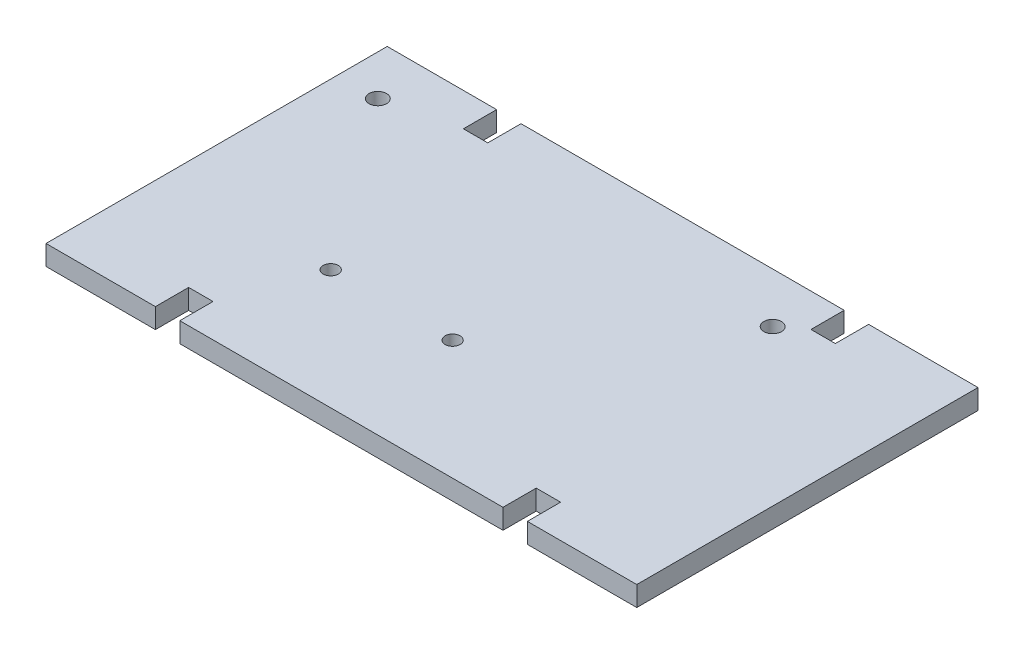
ISO-10303-21;
HEADER;
FILE_DESCRIPTION(('STEP AP214'),'2;1');
FILE_NAME('part.step','',(''),(''),'','','');
FILE_SCHEMA(('AUTOMOTIVE_DESIGN { 1 0 10303 214 1 1 1 1 }'));
ENDSEC;
DATA;
#1=APPLICATION_CONTEXT('core data for automotive mechanical design processes');
#2=APPLICATION_PROTOCOL_DEFINITION('international standard','automotive_design',2000,#1);
#3=PRODUCT_CONTEXT('',#1,'mechanical');
#4=PRODUCT('Part','Part','',(#3));
#5=PRODUCT_RELATED_PRODUCT_CATEGORY('part','',(#4));
#6=PRODUCT_DEFINITION_FORMATION('','',#4);
#7=PRODUCT_DEFINITION_CONTEXT('part definition',#1,'design');
#8=PRODUCT_DEFINITION('design','',#6,#7);
#9=PRODUCT_DEFINITION_SHAPE('','',#8);
#10=(LENGTH_UNIT() NAMED_UNIT(*) SI_UNIT(.MILLI.,.METRE.));
#11=(NAMED_UNIT(*) PLANE_ANGLE_UNIT() SI_UNIT($,.RADIAN.));
#12=(NAMED_UNIT(*) SI_UNIT($,.STERADIAN.) SOLID_ANGLE_UNIT());
#13=UNCERTAINTY_MEASURE_WITH_UNIT(LENGTH_MEASURE(1.E-05),#10,'distance_accuracy_value','');
#14=(GEOMETRIC_REPRESENTATION_CONTEXT(3) GLOBAL_UNCERTAINTY_ASSIGNED_CONTEXT((#13)) GLOBAL_UNIT_ASSIGNED_CONTEXT((#10,
#11,#12)) REPRESENTATION_CONTEXT('',''));
#15=CARTESIAN_POINT('',(0.,0.,0.));
#16=DIRECTION('',(0.,0.,1.));
#17=DIRECTION('',(1.,0.,0.));
#18=AXIS2_PLACEMENT_3D('',#15,#16,#17);
#19=CARTESIAN_POINT('',(67.691,4.572,0.));
#20=DIRECTION('',(1.,0.,0.));
#21=DIRECTION('',(0.,0.,-1.));
#22=AXIS2_PLACEMENT_3D('',#19,#20,#21);
#23=PLANE('',#22);
#24=DIRECTION('',(0.,0.,1.));
#25=VECTOR('',#24,1.);
#26=CARTESIAN_POINT('',(67.691,0.,0.));
#27=LINE('',#26,#25);
#28=CARTESIAN_POINT('',(67.691,0.,-39.1));
#29=VERTEX_POINT('',#28);
#30=CARTESIAN_POINT('',(67.691,0.,39.1));
#31=VERTEX_POINT('',#30);
#32=EDGE_CURVE('E202',#29,#31,#27,.T.);
#33=ORIENTED_EDGE('',*,*,#32,.F.);
#34=DIRECTION('',(0.,-1.,0.));
#35=VECTOR('',#34,1.);
#36=CARTESIAN_POINT('',(67.691,4.572,-39.1));
#37=LINE('',#36,#35);
#38=CARTESIAN_POINT('',(67.691,4.572,-39.1));
#39=VERTEX_POINT('',#38);
#40=EDGE_CURVE('E11',#39,#29,#37,.T.);
#41=ORIENTED_EDGE('',*,*,#40,.F.);
#42=DIRECTION('',(0.,0.,1.));
#43=VECTOR('',#42,1.);
#44=CARTESIAN_POINT('',(67.691,4.572,0.));
#45=LINE('',#44,#43);
#46=CARTESIAN_POINT('',(67.691,4.572,39.1));
#47=VERTEX_POINT('',#46);
#48=EDGE_CURVE('E253',#39,#47,#45,.T.);
#49=ORIENTED_EDGE('',*,*,#48,.T.);
#50=DIRECTION('',(0.,-1.,0.));
#51=VECTOR('',#50,1.);
#52=CARTESIAN_POINT('',(67.691,4.572,39.1));
#53=LINE('',#52,#51);
#54=EDGE_CURVE('E51',#47,#31,#53,.T.);
#55=ORIENTED_EDGE('',*,*,#54,.T.);
#56=EDGE_LOOP('',(#33,#41,#49,#55));
#57=FACE_BOUND('',#56,.T.);
#58=ADVANCED_FACE('F35',(#57),#23,.T.);
#59=CARTESIAN_POINT('',(0.,4.572,-39.1));
#60=DIRECTION('',(0.,0.,1.));
#61=DIRECTION('',(1.,0.,0.));
#62=AXIS2_PLACEMENT_3D('',#59,#60,#61);
#63=PLANE('',#62);
#64=DIRECTION('',(-1.,0.,0.));
#65=VECTOR('',#64,1.);
#66=CARTESIAN_POINT('',(0.,0.,-39.1));
#67=LINE('',#66,#65);
#68=CARTESIAN_POINT('',(42.6212,0.,-39.1));
#69=VERTEX_POINT('',#68);
#70=EDGE_CURVE('E204',#29,#69,#67,.T.);
#71=ORIENTED_EDGE('',*,*,#70,.T.);
#72=DIRECTION('',(0.,-1.,0.));
#73=VECTOR('',#72,1.);
#74=CARTESIAN_POINT('',(42.6212,4.572,-39.1));
#75=LINE('',#74,#73);
#76=CARTESIAN_POINT('',(42.6212,4.572,-39.1));
#77=VERTEX_POINT('',#76);
#78=EDGE_CURVE('E43',#77,#69,#75,.T.);
#79=ORIENTED_EDGE('',*,*,#78,.F.);
#80=DIRECTION('',(-1.,0.,0.));
#81=VECTOR('',#80,1.);
#82=CARTESIAN_POINT('',(0.,4.572,-39.1));
#83=LINE('',#82,#81);
#84=EDGE_CURVE('E307',#39,#77,#83,.T.);
#85=ORIENTED_EDGE('',*,*,#84,.F.);
#86=ORIENTED_EDGE('',*,*,#40,.T.);
#87=EDGE_LOOP('',(#71,#79,#85,#86));
#88=FACE_BOUND('',#87,.T.);
#89=ADVANCED_FACE('F296',(#88),#63,.F.);
#90=CARTESIAN_POINT('',(42.6212000000001,4.572,-1.16434639707564E-13));
#91=DIRECTION('',(-1.,0.,0.));
#92=DIRECTION('',(0.,0.,1.));
#93=AXIS2_PLACEMENT_3D('',#90,#91,#92);
#94=PLANE('',#93);
#95=DIRECTION('',(0.,0.,-1.));
#96=VECTOR('',#95,1.);
#97=CARTESIAN_POINT('',(42.6212000000001,0.,-1.16434639707564E-13));
#98=LINE('',#97,#96);
#99=CARTESIAN_POINT('',(42.6212,0.,-31.48));
#100=VERTEX_POINT('',#99);
#101=EDGE_CURVE('E208',#100,#69,#98,.T.);
#102=ORIENTED_EDGE('',*,*,#101,.F.);
#103=DIRECTION('',(0.,-1.,0.));
#104=VECTOR('',#103,1.);
#105=CARTESIAN_POINT('',(42.6212,4.572,-31.48));
#106=LINE('',#105,#104);
#107=CARTESIAN_POINT('',(42.6212,4.572,-31.48));
#108=VERTEX_POINT('',#107);
#109=EDGE_CURVE('E286',#108,#100,#106,.T.);
#110=ORIENTED_EDGE('',*,*,#109,.F.);
#111=DIRECTION('',(0.,0.,-1.));
#112=VECTOR('',#111,1.);
#113=CARTESIAN_POINT('',(42.6212000000001,4.572,-1.16434639707564E-13));
#114=LINE('',#113,#112);
#115=EDGE_CURVE('E293',#108,#77,#114,.T.);
#116=ORIENTED_EDGE('',*,*,#115,.T.);
#117=ORIENTED_EDGE('',*,*,#78,.T.);
#118=EDGE_LOOP('',(#102,#110,#116,#117));
#119=FACE_BOUND('',#118,.T.);
#120=ADVANCED_FACE('F291',(#119),#94,.T.);
#121=CARTESIAN_POINT('',(0.,4.572,-31.48));
#122=DIRECTION('',(0.,0.,-1.));
#123=DIRECTION('',(-1.,0.,0.));
#124=AXIS2_PLACEMENT_3D('',#121,#122,#123);
#125=PLANE('',#124);
#126=DIRECTION('',(1.,0.,0.));
#127=VECTOR('',#126,1.);
#128=CARTESIAN_POINT('',(0.,0.,-31.48));
#129=LINE('',#128,#127);
#130=CARTESIAN_POINT('',(37.0332,0.,-31.48));
#131=VERTEX_POINT('',#130);
#132=EDGE_CURVE('E211',#131,#100,#129,.T.);
#133=ORIENTED_EDGE('',*,*,#132,.F.);
#134=DIRECTION('',(0.,-1.,0.));
#135=VECTOR('',#134,1.);
#136=CARTESIAN_POINT('',(37.0332,4.572,-31.48));
#137=LINE('',#136,#135);
#138=CARTESIAN_POINT('',(37.0332,4.572,-31.48));
#139=VERTEX_POINT('',#138);
#140=EDGE_CURVE('E284',#139,#131,#137,.T.);
#141=ORIENTED_EDGE('',*,*,#140,.F.);
#142=DIRECTION('',(1.,0.,0.));
#143=VECTOR('',#142,1.);
#144=CARTESIAN_POINT('',(0.,4.572,-31.48));
#145=LINE('',#144,#143);
#146=EDGE_CURVE('E306',#139,#108,#145,.T.);
#147=ORIENTED_EDGE('',*,*,#146,.T.);
#148=ORIENTED_EDGE('',*,*,#109,.T.);
#149=EDGE_LOOP('',(#133,#141,#147,#148));
#150=FACE_BOUND('',#149,.T.);
#151=ADVANCED_FACE('F302',(#150),#125,.T.);
#152=CARTESIAN_POINT('',(37.0331999999999,4.572,0.));
#153=DIRECTION('',(-1.,0.,0.));
#154=DIRECTION('',(0.,0.,1.));
#155=AXIS2_PLACEMENT_3D('',#152,#153,#154);
#156=PLANE('',#155);
#157=DIRECTION('',(0.,0.,-1.));
#158=VECTOR('',#157,1.);
#159=CARTESIAN_POINT('',(37.0331999999999,0.,0.));
#160=LINE('',#159,#158);
#161=CARTESIAN_POINT('',(37.0332,0.,-39.1));
#162=VERTEX_POINT('',#161);
#163=EDGE_CURVE('E214',#131,#162,#160,.T.);
#164=ORIENTED_EDGE('',*,*,#163,.T.);
#165=DIRECTION('',(0.,-1.,0.));
#166=VECTOR('',#165,1.);
#167=CARTESIAN_POINT('',(37.0332,4.572,-39.1));
#168=LINE('',#167,#166);
#169=CARTESIAN_POINT('',(37.0332,4.572,-39.1));
#170=VERTEX_POINT('',#169);
#171=EDGE_CURVE('E282',#170,#162,#168,.T.);
#172=ORIENTED_EDGE('',*,*,#171,.F.);
#173=DIRECTION('',(0.,0.,-1.));
#174=VECTOR('',#173,1.);
#175=CARTESIAN_POINT('',(37.0331999999999,4.572,0.));
#176=LINE('',#175,#174);
#177=EDGE_CURVE('E309',#139,#170,#176,.T.);
#178=ORIENTED_EDGE('',*,*,#177,.F.);
#179=ORIENTED_EDGE('',*,*,#140,.T.);
#180=EDGE_LOOP('',(#164,#172,#178,#179));
#181=FACE_BOUND('',#180,.T.);
#182=ADVANCED_FACE('F362',(#181),#156,.F.);
#183=CARTESIAN_POINT('',(0.,4.572,-39.1));
#184=DIRECTION('',(0.,0.,-1.));
#185=DIRECTION('',(-1.,0.,0.));
#186=AXIS2_PLACEMENT_3D('',#183,#184,#185);
#187=PLANE('',#186);
#188=DIRECTION('',(1.,0.,0.));
#189=VECTOR('',#188,1.);
#190=CARTESIAN_POINT('',(0.,0.,-39.1));
#191=LINE('',#190,#189);
#192=CARTESIAN_POINT('',(-37.0332,0.,-39.1));
#193=VERTEX_POINT('',#192);
#194=EDGE_CURVE('E218',#193,#162,#191,.T.);
#195=ORIENTED_EDGE('',*,*,#194,.F.);
#196=DIRECTION('',(0.,-1.,0.));
#197=VECTOR('',#196,1.);
#198=CARTESIAN_POINT('',(-37.0332,4.572,-39.1));
#199=LINE('',#198,#197);
#200=CARTESIAN_POINT('',(-37.0332,4.572,-39.1));
#201=VERTEX_POINT('',#200);
#202=EDGE_CURVE('E280',#201,#193,#199,.T.);
#203=ORIENTED_EDGE('',*,*,#202,.F.);
#204=DIRECTION('',(1.,0.,0.));
#205=VECTOR('',#204,1.);
#206=CARTESIAN_POINT('',(0.,4.572,-39.1));
#207=LINE('',#206,#205);
#208=EDGE_CURVE('E316',#201,#170,#207,.T.);
#209=ORIENTED_EDGE('',*,*,#208,.T.);
#210=ORIENTED_EDGE('',*,*,#171,.T.);
#211=EDGE_LOOP('',(#195,#203,#209,#210));
#212=FACE_BOUND('',#211,.T.);
#213=ADVANCED_FACE('F365',(#212),#187,.T.);
#214=CARTESIAN_POINT('',(-37.0331999999999,4.572,0.));
#215=DIRECTION('',(-1.,0.,0.));
#216=DIRECTION('',(0.,0.,1.));
#217=AXIS2_PLACEMENT_3D('',#214,#215,#216);
#218=PLANE('',#217);
#219=DIRECTION('',(0.,0.,-1.));
#220=VECTOR('',#219,1.);
#221=CARTESIAN_POINT('',(-37.0331999999999,0.,0.));
#222=LINE('',#221,#220);
#223=CARTESIAN_POINT('',(-37.0331999999999,0.,-31.48));
#224=VERTEX_POINT('',#223);
#225=EDGE_CURVE('E221',#224,#193,#222,.T.);
#226=ORIENTED_EDGE('',*,*,#225,.F.);
#227=DIRECTION('',(0.,-1.,0.));
#228=VECTOR('',#227,1.);
#229=CARTESIAN_POINT('',(-37.0331999999999,4.572,-31.48));
#230=LINE('',#229,#228);
#231=CARTESIAN_POINT('',(-37.0331999999999,4.572,-31.48));
#232=VERTEX_POINT('',#231);
#233=EDGE_CURVE('E278',#232,#224,#230,.T.);
#234=ORIENTED_EDGE('',*,*,#233,.F.);
#235=DIRECTION('',(0.,0.,-1.));
#236=VECTOR('',#235,1.);
#237=CARTESIAN_POINT('',(-37.0331999999999,4.572,0.));
#238=LINE('',#237,#236);
#239=EDGE_CURVE('E319',#232,#201,#238,.T.);
#240=ORIENTED_EDGE('',*,*,#239,.T.);
#241=ORIENTED_EDGE('',*,*,#202,.T.);
#242=EDGE_LOOP('',(#226,#234,#240,#241));
#243=FACE_BOUND('',#242,.T.);
#244=ADVANCED_FACE('F369',(#243),#218,.T.);
#245=CARTESIAN_POINT('',(-42.6212,0.,-31.48));
#246=VERTEX_POINT('',#245);
#247=EDGE_CURVE('E215',#246,#224,#129,.T.);
#248=ORIENTED_EDGE('',*,*,#247,.F.);
#249=DIRECTION('',(0.,-1.,0.));
#250=VECTOR('',#249,1.);
#251=CARTESIAN_POINT('',(-42.6212,4.572,-31.48));
#252=LINE('',#251,#250);
#253=CARTESIAN_POINT('',(-42.6212,4.572,-31.48));
#254=VERTEX_POINT('',#253);
#255=EDGE_CURVE('E276',#254,#246,#252,.T.);
#256=ORIENTED_EDGE('',*,*,#255,.F.);
#257=EDGE_CURVE('E311',#254,#232,#145,.T.);
#258=ORIENTED_EDGE('',*,*,#257,.T.);
#259=ORIENTED_EDGE('',*,*,#233,.T.);
#260=EDGE_LOOP('',(#248,#256,#258,#259));
#261=FACE_BOUND('',#260,.T.);
#262=ADVANCED_FACE('F373',(#261),#125,.T.);
#263=CARTESIAN_POINT('',(-42.6212000000001,4.572,0.));
#264=DIRECTION('',(-1.,0.,0.));
#265=DIRECTION('',(0.,0.,1.));
#266=AXIS2_PLACEMENT_3D('',#263,#264,#265);
#267=PLANE('',#266);
#268=DIRECTION('',(0.,0.,-1.));
#269=VECTOR('',#268,1.);
#270=CARTESIAN_POINT('',(-42.6212000000001,0.,0.));
#271=LINE('',#270,#269);
#272=CARTESIAN_POINT('',(-42.6212,0.,-39.1));
#273=VERTEX_POINT('',#272);
#274=EDGE_CURVE('E224',#246,#273,#271,.T.);
#275=ORIENTED_EDGE('',*,*,#274,.T.);
#276=DIRECTION('',(0.,-1.,0.));
#277=VECTOR('',#276,1.);
#278=CARTESIAN_POINT('',(-42.6212,4.572,-39.1));
#279=LINE('',#278,#277);
#280=CARTESIAN_POINT('',(-42.6212,4.572,-39.1));
#281=VERTEX_POINT('',#280);
#282=EDGE_CURVE('E274',#281,#273,#279,.T.);
#283=ORIENTED_EDGE('',*,*,#282,.F.);
#284=DIRECTION('',(0.,0.,-1.));
#285=VECTOR('',#284,1.);
#286=CARTESIAN_POINT('',(-42.6212000000001,4.572,0.));
#287=LINE('',#286,#285);
#288=EDGE_CURVE('E322',#254,#281,#287,.T.);
#289=ORIENTED_EDGE('',*,*,#288,.F.);
#290=ORIENTED_EDGE('',*,*,#255,.T.);
#291=EDGE_LOOP('',(#275,#283,#289,#290));
#292=FACE_BOUND('',#291,.T.);
#293=ADVANCED_FACE('F377',(#292),#267,.F.);
#294=CARTESIAN_POINT('',(0.,4.572,-39.1));
#295=DIRECTION('',(0.,0.,-1.));
#296=DIRECTION('',(-1.,0.,0.));
#297=AXIS2_PLACEMENT_3D('',#294,#295,#296);
#298=PLANE('',#297);
#299=DIRECTION('',(1.,0.,0.));
#300=VECTOR('',#299,1.);
#301=CARTESIAN_POINT('',(0.,0.,-39.1));
#302=LINE('',#301,#300);
#303=CARTESIAN_POINT('',(-67.691,0.,-39.1));
#304=VERTEX_POINT('',#303);
#305=EDGE_CURVE('E227',#304,#273,#302,.T.);
#306=ORIENTED_EDGE('',*,*,#305,.F.);
#307=DIRECTION('',(0.,-1.,0.));
#308=VECTOR('',#307,1.);
#309=CARTESIAN_POINT('',(-67.691,4.572,-39.1));
#310=LINE('',#309,#308);
#311=CARTESIAN_POINT('',(-67.691,4.572,-39.1));
#312=VERTEX_POINT('',#311);
#313=EDGE_CURVE('E272',#312,#304,#310,.T.);
#314=ORIENTED_EDGE('',*,*,#313,.F.);
#315=DIRECTION('',(1.,0.,0.));
#316=VECTOR('',#315,1.);
#317=CARTESIAN_POINT('',(0.,4.572,-39.1));
#318=LINE('',#317,#316);
#319=EDGE_CURVE('E324',#312,#281,#318,.T.);
#320=ORIENTED_EDGE('',*,*,#319,.T.);
#321=ORIENTED_EDGE('',*,*,#282,.T.);
#322=EDGE_LOOP('',(#306,#314,#320,#321));
#323=FACE_BOUND('',#322,.T.);
#324=ADVANCED_FACE('F381',(#323),#298,.T.);
#325=CARTESIAN_POINT('',(-67.691,4.572,0.));
#326=DIRECTION('',(1.,0.,0.));
#327=DIRECTION('',(0.,0.,-1.));
#328=AXIS2_PLACEMENT_3D('',#325,#326,#327);
#329=PLANE('',#328);
#330=DIRECTION('',(0.,0.,1.));
#331=VECTOR('',#330,1.);
#332=CARTESIAN_POINT('',(-67.691,0.,0.));
#333=LINE('',#332,#331);
#334=CARTESIAN_POINT('',(-67.691,0.,39.1));
#335=VERTEX_POINT('',#334);
#336=EDGE_CURVE('E230',#304,#335,#333,.T.);
#337=ORIENTED_EDGE('',*,*,#336,.T.);
#338=DIRECTION('',(0.,-1.,0.));
#339=VECTOR('',#338,1.);
#340=CARTESIAN_POINT('',(-67.691,4.572,39.1));
#341=LINE('',#340,#339);
#342=CARTESIAN_POINT('',(-67.691,4.572,39.1));
#343=VERTEX_POINT('',#342);
#344=EDGE_CURVE('E269',#343,#335,#341,.T.);
#345=ORIENTED_EDGE('',*,*,#344,.F.);
#346=DIRECTION('',(0.,0.,1.));
#347=VECTOR('',#346,1.);
#348=CARTESIAN_POINT('',(-67.691,4.572,0.));
#349=LINE('',#348,#347);
#350=EDGE_CURVE('E327',#312,#343,#349,.T.);
#351=ORIENTED_EDGE('',*,*,#350,.F.);
#352=ORIENTED_EDGE('',*,*,#313,.T.);
#353=EDGE_LOOP('',(#337,#345,#351,#352));
#354=FACE_BOUND('',#353,.T.);
#355=ADVANCED_FACE('F385',(#354),#329,.F.);
#356=CARTESIAN_POINT('',(0.,4.572,39.1));
#357=DIRECTION('',(0.,0.,-1.));
#358=DIRECTION('',(-1.,0.,0.));
#359=AXIS2_PLACEMENT_3D('',#356,#357,#358);
#360=PLANE('',#359);
#361=DIRECTION('',(1.,0.,0.));
#362=VECTOR('',#361,1.);
#363=CARTESIAN_POINT('',(0.,0.,39.1));
#364=LINE('',#363,#362);
#365=CARTESIAN_POINT('',(-42.6212,0.,39.1));
#366=VERTEX_POINT('',#365);
#367=EDGE_CURVE('E232',#335,#366,#364,.T.);
#368=ORIENTED_EDGE('',*,*,#367,.T.);
#369=DIRECTION('',(0.,-1.,0.));
#370=VECTOR('',#369,1.);
#371=CARTESIAN_POINT('',(-42.6212,4.572,39.1));
#372=LINE('',#371,#370);
#373=CARTESIAN_POINT('',(-42.6212,4.572,39.1));
#374=VERTEX_POINT('',#373);
#375=EDGE_CURVE('E267',#374,#366,#372,.T.);
#376=ORIENTED_EDGE('',*,*,#375,.F.);
#377=DIRECTION('',(1.,0.,0.));
#378=VECTOR('',#377,1.);
#379=CARTESIAN_POINT('',(0.,4.572,39.1));
#380=LINE('',#379,#378);
#381=EDGE_CURVE('E329',#343,#374,#380,.T.);
#382=ORIENTED_EDGE('',*,*,#381,.F.);
#383=ORIENTED_EDGE('',*,*,#344,.T.);
#384=EDGE_LOOP('',(#368,#376,#382,#383));
#385=FACE_BOUND('',#384,.T.);
#386=ADVANCED_FACE('F389',(#385),#360,.F.);
#387=CARTESIAN_POINT('',(-42.6212000000001,4.572,1.16434639707564E-13));
#388=DIRECTION('',(1.,0.,0.));
#389=DIRECTION('',(0.,0.,-1.));
#390=AXIS2_PLACEMENT_3D('',#387,#388,#389);
#391=PLANE('',#390);
#392=DIRECTION('',(0.,0.,1.));
#393=VECTOR('',#392,1.);
#394=CARTESIAN_POINT('',(-42.6212000000001,0.,1.16434639707564E-13));
#395=LINE('',#394,#393);
#396=CARTESIAN_POINT('',(-42.6212,0.,31.48));
#397=VERTEX_POINT('',#396);
#398=EDGE_CURVE('E235',#397,#366,#395,.T.);
#399=ORIENTED_EDGE('',*,*,#398,.F.);
#400=DIRECTION('',(0.,-1.,0.));
#401=VECTOR('',#400,1.);
#402=CARTESIAN_POINT('',(-42.6212,4.572,31.48));
#403=LINE('',#402,#401);
#404=CARTESIAN_POINT('',(-42.6212,4.572,31.48));
#405=VERTEX_POINT('',#404);
#406=EDGE_CURVE('E265',#405,#397,#403,.T.);
#407=ORIENTED_EDGE('',*,*,#406,.F.);
#408=DIRECTION('',(0.,0.,1.));
#409=VECTOR('',#408,1.);
#410=CARTESIAN_POINT('',(-42.6212000000001,4.572,1.16434639707564E-13));
#411=LINE('',#410,#409);
#412=EDGE_CURVE('E331',#405,#374,#411,.T.);
#413=ORIENTED_EDGE('',*,*,#412,.T.);
#414=ORIENTED_EDGE('',*,*,#375,.T.);
#415=EDGE_LOOP('',(#399,#407,#413,#414));
#416=FACE_BOUND('',#415,.T.);
#417=ADVANCED_FACE('F393',(#416),#391,.T.);
#418=CARTESIAN_POINT('',(0.,4.572,31.48));
#419=DIRECTION('',(0.,0.,-1.));
#420=DIRECTION('',(-1.,0.,0.));
#421=AXIS2_PLACEMENT_3D('',#418,#419,#420);
#422=PLANE('',#421);
#423=DIRECTION('',(1.,0.,0.));
#424=VECTOR('',#423,1.);
#425=CARTESIAN_POINT('',(0.,0.,31.48));
#426=LINE('',#425,#424);
#427=CARTESIAN_POINT('',(-37.0331999999999,0.,31.48));
#428=VERTEX_POINT('',#427);
#429=EDGE_CURVE('E238',#397,#428,#426,.T.);
#430=ORIENTED_EDGE('',*,*,#429,.T.);
#431=DIRECTION('',(0.,-1.,0.));
#432=VECTOR('',#431,1.);
#433=CARTESIAN_POINT('',(-37.0331999999999,4.572,31.48));
#434=LINE('',#433,#432);
#435=CARTESIAN_POINT('',(-37.0331999999999,4.572,31.48));
#436=VERTEX_POINT('',#435);
#437=EDGE_CURVE('E262',#436,#428,#434,.T.);
#438=ORIENTED_EDGE('',*,*,#437,.F.);
#439=DIRECTION('',(1.,0.,0.));
#440=VECTOR('',#439,1.);
#441=CARTESIAN_POINT('',(0.,4.572,31.48));
#442=LINE('',#441,#440);
#443=EDGE_CURVE('E185',#405,#436,#442,.T.);
#444=ORIENTED_EDGE('',*,*,#443,.F.);
#445=ORIENTED_EDGE('',*,*,#406,.T.);
#446=EDGE_LOOP('',(#430,#438,#444,#445));
#447=FACE_BOUND('',#446,.T.);
#448=ADVANCED_FACE('F397',(#447),#422,.F.);
#449=CARTESIAN_POINT('',(-37.0331999999999,4.572,0.));
#450=DIRECTION('',(1.,0.,0.));
#451=DIRECTION('',(0.,0.,-1.));
#452=AXIS2_PLACEMENT_3D('',#449,#450,#451);
#453=PLANE('',#452);
#454=DIRECTION('',(0.,0.,1.));
#455=VECTOR('',#454,1.);
#456=CARTESIAN_POINT('',(-37.0331999999999,0.,0.));
#457=LINE('',#456,#455);
#458=CARTESIAN_POINT('',(-37.0332,0.,39.1));
#459=VERTEX_POINT('',#458);
#460=EDGE_CURVE('E240',#428,#459,#457,.T.);
#461=ORIENTED_EDGE('',*,*,#460,.T.);
#462=DIRECTION('',(0.,-1.,0.));
#463=VECTOR('',#462,1.);
#464=CARTESIAN_POINT('',(-37.0332,4.572,39.1));
#465=LINE('',#464,#463);
#466=CARTESIAN_POINT('',(-37.0332,4.572,39.1));
#467=VERTEX_POINT('',#466);
#468=EDGE_CURVE('E259',#467,#459,#465,.T.);
#469=ORIENTED_EDGE('',*,*,#468,.F.);
#470=DIRECTION('',(0.,0.,1.));
#471=VECTOR('',#470,1.);
#472=CARTESIAN_POINT('',(-37.0331999999999,4.572,0.));
#473=LINE('',#472,#471);
#474=EDGE_CURVE('E334',#436,#467,#473,.T.);
#475=ORIENTED_EDGE('',*,*,#474,.F.);
#476=ORIENTED_EDGE('',*,*,#437,.T.);
#477=EDGE_LOOP('',(#461,#469,#475,#476));
#478=FACE_BOUND('',#477,.T.);
#479=ADVANCED_FACE('F399',(#478),#453,.F.);
#480=CARTESIAN_POINT('',(0.,4.572,39.1));
#481=DIRECTION('',(0.,0.,-1.));
#482=DIRECTION('',(-1.,0.,0.));
#483=AXIS2_PLACEMENT_3D('',#480,#481,#482);
#484=PLANE('',#483);
#485=DIRECTION('',(1.,0.,0.));
#486=VECTOR('',#485,1.);
#487=CARTESIAN_POINT('',(0.,0.,39.1));
#488=LINE('',#487,#486);
#489=CARTESIAN_POINT('',(37.0332,0.,39.1));
#490=VERTEX_POINT('',#489);
#491=EDGE_CURVE('E242',#459,#490,#488,.T.);
#492=ORIENTED_EDGE('',*,*,#491,.T.);
#493=DIRECTION('',(0.,-1.,0.));
#494=VECTOR('',#493,1.);
#495=CARTESIAN_POINT('',(37.0332,4.572,39.1));
#496=LINE('',#495,#494);
#497=CARTESIAN_POINT('',(37.0332,4.572,39.1));
#498=VERTEX_POINT('',#497);
#499=EDGE_CURVE('E257',#498,#490,#496,.T.);
#500=ORIENTED_EDGE('',*,*,#499,.F.);
#501=DIRECTION('',(1.,0.,0.));
#502=VECTOR('',#501,1.);
#503=CARTESIAN_POINT('',(0.,4.572,39.1));
#504=LINE('',#503,#502);
#505=EDGE_CURVE('E335',#467,#498,#504,.T.);
#506=ORIENTED_EDGE('',*,*,#505,.F.);
#507=ORIENTED_EDGE('',*,*,#468,.T.);
#508=EDGE_LOOP('',(#492,#500,#506,#507));
#509=FACE_BOUND('',#508,.T.);
#510=ADVANCED_FACE('F402',(#509),#484,.F.);
#511=CARTESIAN_POINT('',(37.0331999999999,4.572,0.));
#512=DIRECTION('',(1.,0.,0.));
#513=DIRECTION('',(0.,0.,-1.));
#514=AXIS2_PLACEMENT_3D('',#511,#512,#513);
#515=PLANE('',#514);
#516=DIRECTION('',(0.,0.,1.));
#517=VECTOR('',#516,1.);
#518=CARTESIAN_POINT('',(37.0331999999999,0.,0.));
#519=LINE('',#518,#517);
#520=CARTESIAN_POINT('',(37.0332,0.,31.48));
#521=VERTEX_POINT('',#520);
#522=EDGE_CURVE('E245',#521,#490,#519,.T.);
#523=ORIENTED_EDGE('',*,*,#522,.F.);
#524=DIRECTION('',(0.,-1.,0.));
#525=VECTOR('',#524,1.);
#526=CARTESIAN_POINT('',(37.0332,4.572,31.48));
#527=LINE('',#526,#525);
#528=CARTESIAN_POINT('',(37.0332,4.572,31.48));
#529=VERTEX_POINT('',#528);
#530=EDGE_CURVE('E193',#529,#521,#527,.T.);
#531=ORIENTED_EDGE('',*,*,#530,.F.);
#532=DIRECTION('',(0.,0.,1.));
#533=VECTOR('',#532,1.);
#534=CARTESIAN_POINT('',(37.0331999999999,4.572,0.));
#535=LINE('',#534,#533);
#536=EDGE_CURVE('E182',#529,#498,#535,.T.);
#537=ORIENTED_EDGE('',*,*,#536,.T.);
#538=ORIENTED_EDGE('',*,*,#499,.T.);
#539=EDGE_LOOP('',(#523,#531,#537,#538));
#540=FACE_BOUND('',#539,.T.);
#541=ADVANCED_FACE('F340',(#540),#515,.T.);
#542=CARTESIAN_POINT('',(42.6212,0.,31.48));
#543=VERTEX_POINT('',#542);
#544=EDGE_CURVE('E190',#521,#543,#426,.T.);
#545=ORIENTED_EDGE('',*,*,#544,.T.);
#546=DIRECTION('',(0.,-1.,0.));
#547=VECTOR('',#546,1.);
#548=CARTESIAN_POINT('',(42.6212,4.572,31.48));
#549=LINE('',#548,#547);
#550=CARTESIAN_POINT('',(42.6212,4.572,31.48));
#551=VERTEX_POINT('',#550);
#552=EDGE_CURVE('E187',#551,#543,#549,.T.);
#553=ORIENTED_EDGE('',*,*,#552,.F.);
#554=EDGE_CURVE('E174',#529,#551,#442,.T.);
#555=ORIENTED_EDGE('',*,*,#554,.F.);
#556=ORIENTED_EDGE('',*,*,#530,.T.);
#557=EDGE_LOOP('',(#545,#553,#555,#556));
#558=FACE_BOUND('',#557,.T.);
#559=ADVANCED_FACE('F188',(#558),#422,.F.);
#560=CARTESIAN_POINT('',(42.6212000000001,4.572,1.16434639707564E-13));
#561=DIRECTION('',(1.,0.,0.));
#562=DIRECTION('',(0.,0.,-1.));
#563=AXIS2_PLACEMENT_3D('',#560,#561,#562);
#564=PLANE('',#563);
#565=DIRECTION('',(0.,0.,1.));
#566=VECTOR('',#565,1.);
#567=CARTESIAN_POINT('',(42.6212000000001,0.,1.16434639707564E-13));
#568=LINE('',#567,#566);
#569=CARTESIAN_POINT('',(42.6212,0.,39.1));
#570=VERTEX_POINT('',#569);
#571=EDGE_CURVE('E248',#543,#570,#568,.T.);
#572=ORIENTED_EDGE('',*,*,#571,.T.);
#573=DIRECTION('',(0.,-1.,0.));
#574=VECTOR('',#573,1.);
#575=CARTESIAN_POINT('',(42.6212,4.572,39.1));
#576=LINE('',#575,#574);
#577=CARTESIAN_POINT('',(42.6212,4.572,39.1));
#578=VERTEX_POINT('',#577);
#579=EDGE_CURVE('E113',#578,#570,#576,.T.);
#580=ORIENTED_EDGE('',*,*,#579,.F.);
#581=DIRECTION('',(0.,0.,1.));
#582=VECTOR('',#581,1.);
#583=CARTESIAN_POINT('',(42.6212000000001,4.572,1.16434639707564E-13));
#584=LINE('',#583,#582);
#585=EDGE_CURVE('E180',#551,#578,#584,.T.);
#586=ORIENTED_EDGE('',*,*,#585,.F.);
#587=ORIENTED_EDGE('',*,*,#552,.T.);
#588=EDGE_LOOP('',(#572,#580,#586,#587));
#589=FACE_BOUND('',#588,.T.);
#590=ADVANCED_FACE('F195',(#589),#564,.F.);
#591=CARTESIAN_POINT('',(0.,4.572,39.1));
#592=DIRECTION('',(0.,0.,1.));
#593=DIRECTION('',(1.,0.,0.));
#594=AXIS2_PLACEMENT_3D('',#591,#592,#593);
#595=PLANE('',#594);
#596=DIRECTION('',(-1.,0.,0.));
#597=VECTOR('',#596,1.);
#598=CARTESIAN_POINT('',(0.,0.,39.1));
#599=LINE('',#598,#597);
#600=EDGE_CURVE('E250',#31,#570,#599,.T.);
#601=ORIENTED_EDGE('',*,*,#600,.F.);
#602=ORIENTED_EDGE('',*,*,#54,.F.);
#603=DIRECTION('',(-1.,0.,0.));
#604=VECTOR('',#603,1.);
#605=CARTESIAN_POINT('',(0.,4.572,39.1));
#606=LINE('',#605,#604);
#607=EDGE_CURVE('E196',#47,#578,#606,.T.);
#608=ORIENTED_EDGE('',*,*,#607,.T.);
#609=ORIENTED_EDGE('',*,*,#579,.T.);
#610=EDGE_LOOP('',(#601,#602,#608,#609));
#611=FACE_BOUND('',#610,.T.);
#612=ADVANCED_FACE('F342',(#611),#595,.T.);
#613=CARTESIAN_POINT('',(0.,4.572,0.));
#614=DIRECTION('',(0.,1.,0.));
#615=DIRECTION('',(0.,0.,1.));
#616=AXIS2_PLACEMENT_3D('',#613,#614,#615);
#617=PLANE('',#616);
#618=CARTESIAN_POINT('',(-29.845,4.572,11.7));
#619=DIRECTION('',(0.,1.,0.));
#620=DIRECTION('',(0.,0.,1.));
#621=AXIS2_PLACEMENT_3D('',#618,#619,#620);
#622=CIRCLE('',#621,1.7272);
#623=CARTESIAN_POINT('',(-29.845,4.572,13.4272));
#624=VERTEX_POINT('',#623);
#625=EDGE_CURVE('E550',#624,#624,#622,.T.);
#626=ORIENTED_EDGE('',*,*,#625,.F.);
#627=EDGE_LOOP('',(#626));
#628=FACE_BOUND('',#627,.T.);
#629=CARTESIAN_POINT('',(-1.90499999999999,4.572,11.7));
#630=DIRECTION('',(0.,1.,0.));
#631=DIRECTION('',(0.,0.,1.));
#632=AXIS2_PLACEMENT_3D('',#629,#630,#631);
#633=CIRCLE('',#632,1.7272);
#634=CARTESIAN_POINT('',(-1.90499999999999,4.572,13.4272));
#635=VERTEX_POINT('',#634);
#636=EDGE_CURVE('E552',#635,#635,#633,.T.);
#637=ORIENTED_EDGE('',*,*,#636,.F.);
#638=EDGE_LOOP('',(#637));
#639=FACE_BOUND('',#638,.T.);
#640=CARTESIAN_POINT('',(-58.42,4.572,-27.67));
#641=DIRECTION('',(0.,1.,0.));
#642=DIRECTION('',(0.,0.,1.));
#643=AXIS2_PLACEMENT_3D('',#640,#641,#642);
#644=CIRCLE('',#643,2.01929999999999);
#645=CARTESIAN_POINT('',(-58.42,4.572,-25.6507));
#646=VERTEX_POINT('',#645);
#647=EDGE_CURVE('E560',#646,#646,#644,.T.);
#648=ORIENTED_EDGE('',*,*,#647,.F.);
#649=EDGE_LOOP('',(#648));
#650=FACE_BOUND('',#649,.T.);
#651=CARTESIAN_POINT('',(32.0675,4.572,-27.67));
#652=DIRECTION('',(0.,1.,0.));
#653=DIRECTION('',(0.,0.,1.));
#654=AXIS2_PLACEMENT_3D('',#651,#652,#653);
#655=CIRCLE('',#654,2.01929999999999);
#656=CARTESIAN_POINT('',(32.0675,4.572,-25.6507));
#657=VERTEX_POINT('',#656);
#658=EDGE_CURVE('E566',#657,#657,#655,.T.);
#659=ORIENTED_EDGE('',*,*,#658,.F.);
#660=EDGE_LOOP('',(#659));
#661=FACE_BOUND('',#660,.T.);
#662=ORIENTED_EDGE('',*,*,#48,.F.);
#663=ORIENTED_EDGE('',*,*,#84,.T.);
#664=ORIENTED_EDGE('',*,*,#115,.F.);
#665=ORIENTED_EDGE('',*,*,#146,.F.);
#666=ORIENTED_EDGE('',*,*,#177,.T.);
#667=ORIENTED_EDGE('',*,*,#208,.F.);
#668=ORIENTED_EDGE('',*,*,#239,.F.);
#669=ORIENTED_EDGE('',*,*,#257,.F.);
#670=ORIENTED_EDGE('',*,*,#288,.T.);
#671=ORIENTED_EDGE('',*,*,#319,.F.);
#672=ORIENTED_EDGE('',*,*,#350,.T.);
#673=ORIENTED_EDGE('',*,*,#381,.T.);
#674=ORIENTED_EDGE('',*,*,#412,.F.);
#675=ORIENTED_EDGE('',*,*,#443,.T.);
#676=ORIENTED_EDGE('',*,*,#474,.T.);
#677=ORIENTED_EDGE('',*,*,#505,.T.);
#678=ORIENTED_EDGE('',*,*,#536,.F.);
#679=ORIENTED_EDGE('',*,*,#554,.T.);
#680=ORIENTED_EDGE('',*,*,#585,.T.);
#681=ORIENTED_EDGE('',*,*,#607,.F.);
#682=EDGE_LOOP('',(#662,#663,#664,#665,#666,#667,#668,#669,#670,#671,#672,#673,#674,#675,#676,
#677,#678,#679,#680,#681));
#683=FACE_BOUND('',#682,.T.);
#684=ADVANCED_FACE('F177',(#628,#639,#650,#661,#683),#617,.T.);
#685=CARTESIAN_POINT('',(0.,0.,0.));
#686=DIRECTION('',(0.,1.,0.));
#687=DIRECTION('',(0.,0.,1.));
#688=AXIS2_PLACEMENT_3D('',#685,#686,#687);
#689=PLANE('',#688);
#690=CARTESIAN_POINT('',(-29.845,0.,11.7));
#691=DIRECTION('',(0.,1.,0.));
#692=DIRECTION('',(0.,0.,1.));
#693=AXIS2_PLACEMENT_3D('',#690,#691,#692);
#694=CIRCLE('',#693,1.7272);
#695=CARTESIAN_POINT('',(-29.845,0.,13.4272));
#696=VERTEX_POINT('',#695);
#697=EDGE_CURVE('E547',#696,#696,#694,.T.);
#698=ORIENTED_EDGE('',*,*,#697,.T.);
#699=EDGE_LOOP('',(#698));
#700=FACE_BOUND('',#699,.T.);
#701=CARTESIAN_POINT('',(-1.90499999999999,0.,11.7));
#702=DIRECTION('',(0.,1.,0.));
#703=DIRECTION('',(0.,0.,1.));
#704=AXIS2_PLACEMENT_3D('',#701,#702,#703);
#705=CIRCLE('',#704,1.7272);
#706=CARTESIAN_POINT('',(-1.90499999999999,0.,13.4272));
#707=VERTEX_POINT('',#706);
#708=EDGE_CURVE('E557',#707,#707,#705,.T.);
#709=ORIENTED_EDGE('',*,*,#708,.T.);
#710=EDGE_LOOP('',(#709));
#711=FACE_BOUND('',#710,.T.);
#712=CARTESIAN_POINT('',(-58.42,0.,-27.67));
#713=DIRECTION('',(0.,1.,0.));
#714=DIRECTION('',(0.,0.,1.));
#715=AXIS2_PLACEMENT_3D('',#712,#713,#714);
#716=CIRCLE('',#715,2.01929999999999);
#717=CARTESIAN_POINT('',(-58.42,0.,-25.6507));
#718=VERTEX_POINT('',#717);
#719=EDGE_CURVE('E563',#718,#718,#716,.T.);
#720=ORIENTED_EDGE('',*,*,#719,.T.);
#721=EDGE_LOOP('',(#720));
#722=FACE_BOUND('',#721,.T.);
#723=CARTESIAN_POINT('',(32.0675,0.,-27.67));
#724=DIRECTION('',(0.,1.,0.));
#725=DIRECTION('',(0.,0.,1.));
#726=AXIS2_PLACEMENT_3D('',#723,#724,#725);
#727=CIRCLE('',#726,2.01929999999999);
#728=CARTESIAN_POINT('',(32.0675,0.,-25.6507));
#729=VERTEX_POINT('',#728);
#730=EDGE_CURVE('E205',#729,#729,#727,.T.);
#731=ORIENTED_EDGE('',*,*,#730,.T.);
#732=EDGE_LOOP('',(#731));
#733=FACE_BOUND('',#732,.T.);
#734=ORIENTED_EDGE('',*,*,#32,.T.);
#735=ORIENTED_EDGE('',*,*,#600,.T.);
#736=ORIENTED_EDGE('',*,*,#571,.F.);
#737=ORIENTED_EDGE('',*,*,#544,.F.);
#738=ORIENTED_EDGE('',*,*,#522,.T.);
#739=ORIENTED_EDGE('',*,*,#491,.F.);
#740=ORIENTED_EDGE('',*,*,#460,.F.);
#741=ORIENTED_EDGE('',*,*,#429,.F.);
#742=ORIENTED_EDGE('',*,*,#398,.T.);
#743=ORIENTED_EDGE('',*,*,#367,.F.);
#744=ORIENTED_EDGE('',*,*,#336,.F.);
#745=ORIENTED_EDGE('',*,*,#305,.T.);
#746=ORIENTED_EDGE('',*,*,#274,.F.);
#747=ORIENTED_EDGE('',*,*,#247,.T.);
#748=ORIENTED_EDGE('',*,*,#225,.T.);
#749=ORIENTED_EDGE('',*,*,#194,.T.);
#750=ORIENTED_EDGE('',*,*,#163,.F.);
#751=ORIENTED_EDGE('',*,*,#132,.T.);
#752=ORIENTED_EDGE('',*,*,#101,.T.);
#753=ORIENTED_EDGE('',*,*,#70,.F.);
#754=EDGE_LOOP('',(#734,#735,#736,#737,#738,#739,#740,#741,#742,#743,#744,#745,#746,#747,#748,
#749,#750,#751,#752,#753));
#755=FACE_BOUND('',#754,.T.);
#756=ADVANCED_FACE('F298',(#700,#711,#722,#733,#755),#689,.F.);
#757=CARTESIAN_POINT('',(32.0675,4.572,-27.67));
#758=DIRECTION('',(0.,1.,0.));
#759=DIRECTION('',(0.,0.,1.));
#760=AXIS2_PLACEMENT_3D('',#757,#758,#759);
#761=CYLINDRICAL_SURFACE('',#760,2.01929999999999);
#762=ORIENTED_EDGE('',*,*,#730,.F.);
#763=EDGE_LOOP('',(#762));
#764=FACE_BOUND('',#763,.T.);
#765=ORIENTED_EDGE('',*,*,#658,.T.);
#766=EDGE_LOOP('',(#765));
#767=FACE_BOUND('',#766,.T.);
#768=ADVANCED_FACE('F480',(#764,#767),#761,.F.);
#769=CARTESIAN_POINT('',(-58.42,4.572,-27.67));
#770=DIRECTION('',(0.,1.,0.));
#771=DIRECTION('',(0.,0.,1.));
#772=AXIS2_PLACEMENT_3D('',#769,#770,#771);
#773=CYLINDRICAL_SURFACE('',#772,2.01929999999999);
#774=ORIENTED_EDGE('',*,*,#719,.F.);
#775=EDGE_LOOP('',(#774));
#776=FACE_BOUND('',#775,.T.);
#777=ORIENTED_EDGE('',*,*,#647,.T.);
#778=EDGE_LOOP('',(#777));
#779=FACE_BOUND('',#778,.T.);
#780=ADVANCED_FACE('F486',(#776,#779),#773,.F.);
#781=CARTESIAN_POINT('',(-1.90499999999999,4.572,11.7));
#782=DIRECTION('',(0.,1.,0.));
#783=DIRECTION('',(0.,0.,1.));
#784=AXIS2_PLACEMENT_3D('',#781,#782,#783);
#785=CYLINDRICAL_SURFACE('',#784,1.7272);
#786=ORIENTED_EDGE('',*,*,#708,.F.);
#787=EDGE_LOOP('',(#786));
#788=FACE_BOUND('',#787,.T.);
#789=ORIENTED_EDGE('',*,*,#636,.T.);
#790=EDGE_LOOP('',(#789));
#791=FACE_BOUND('',#790,.T.);
#792=ADVANCED_FACE('F499',(#788,#791),#785,.F.);
#793=CARTESIAN_POINT('',(-29.845,4.572,11.7));
#794=DIRECTION('',(0.,1.,0.));
#795=DIRECTION('',(0.,0.,1.));
#796=AXIS2_PLACEMENT_3D('',#793,#794,#795);
#797=CYLINDRICAL_SURFACE('',#796,1.7272);
#798=ORIENTED_EDGE('',*,*,#697,.F.);
#799=EDGE_LOOP('',(#798));
#800=FACE_BOUND('',#799,.T.);
#801=ORIENTED_EDGE('',*,*,#625,.T.);
#802=EDGE_LOOP('',(#801));
#803=FACE_BOUND('',#802,.T.);
#804=ADVANCED_FACE('F526',(#800,#803),#797,.F.);
#805=CLOSED_SHELL('',(#58,#89,#120,#151,#182,#213,#244,#262,#293,#324,#355,#386,#417,#448,#479,
#510,#541,#559,#590,#612,#684,#756,#768,#780,#792,#804));
#806=MANIFOLD_SOLID_BREP('B2',#805);
#807=ADVANCED_BREP_SHAPE_REPRESENTATION('',(#18,#806),#14);
#808=SHAPE_DEFINITION_REPRESENTATION(#9,#807);
ENDSEC;
END-ISO-10303-21;
